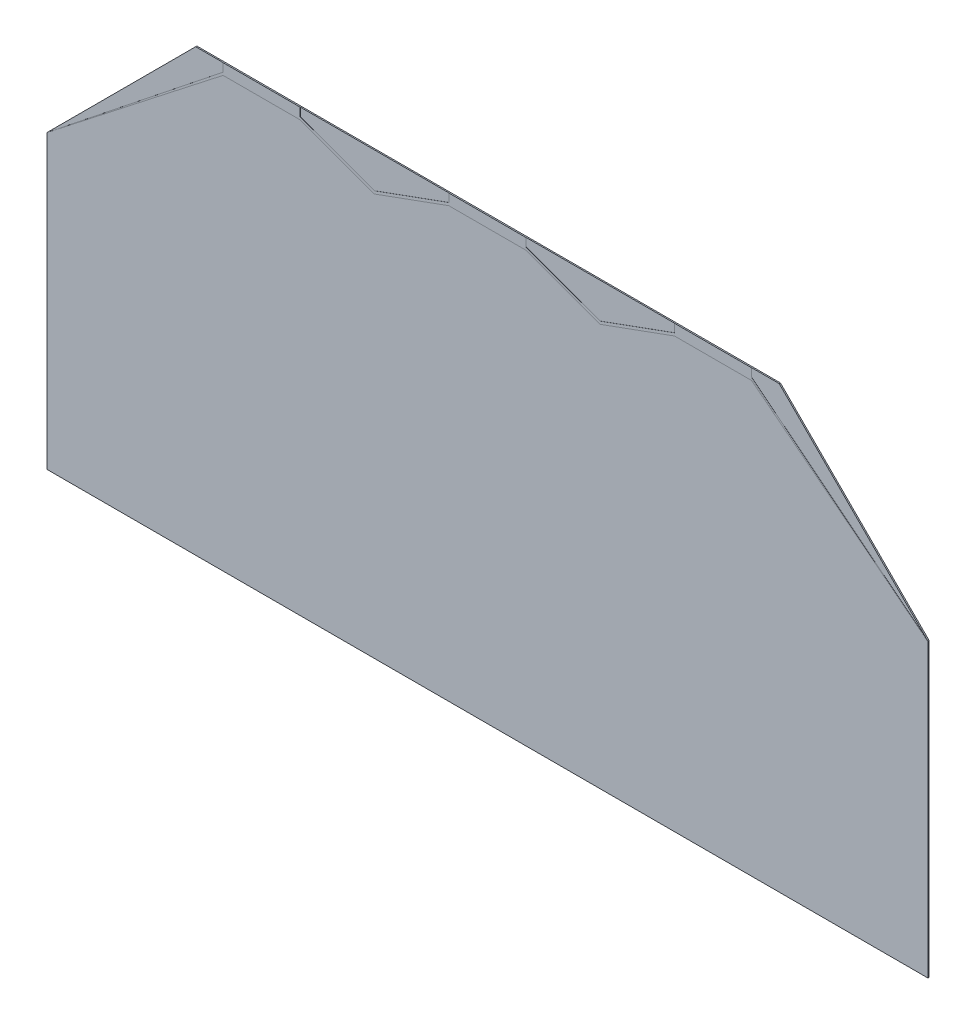
ISO-10303-21;
HEADER;
FILE_DESCRIPTION(('STEP AP214'),'2;1');
FILE_NAME('part.step','',(''),(''),'','','');
FILE_SCHEMA(('AUTOMOTIVE_DESIGN { 1 0 10303 214 1 1 1 1 }'));
ENDSEC;
DATA;
#1=APPLICATION_CONTEXT('core data for automotive mechanical design processes');
#2=APPLICATION_PROTOCOL_DEFINITION('international standard','automotive_design',2000,#1);
#3=PRODUCT_CONTEXT('',#1,'mechanical');
#4=PRODUCT('Part','Part','',(#3));
#5=PRODUCT_RELATED_PRODUCT_CATEGORY('part','',(#4));
#6=PRODUCT_DEFINITION_FORMATION('','',#4);
#7=PRODUCT_DEFINITION_CONTEXT('part definition',#1,'design');
#8=PRODUCT_DEFINITION('design','',#6,#7);
#9=PRODUCT_DEFINITION_SHAPE('','',#8);
#10=(LENGTH_UNIT() NAMED_UNIT(*) SI_UNIT(.MILLI.,.METRE.));
#11=(NAMED_UNIT(*) PLANE_ANGLE_UNIT() SI_UNIT($,.RADIAN.));
#12=(NAMED_UNIT(*) SI_UNIT($,.STERADIAN.) SOLID_ANGLE_UNIT());
#13=UNCERTAINTY_MEASURE_WITH_UNIT(LENGTH_MEASURE(1.E-05),#10,'distance_accuracy_value','');
#14=(GEOMETRIC_REPRESENTATION_CONTEXT(3) GLOBAL_UNCERTAINTY_ASSIGNED_CONTEXT((#13)) GLOBAL_UNIT_ASSIGNED_CONTEXT((#10,
#11,#12)) REPRESENTATION_CONTEXT('',''));
#15=CARTESIAN_POINT('',(0.,0.,0.));
#16=DIRECTION('',(0.,0.,1.));
#17=DIRECTION('',(1.,0.,0.));
#18=AXIS2_PLACEMENT_3D('',#15,#16,#17);
#19=CARTESIAN_POINT('',(0.,0.,-0.11));
#20=DIRECTION('',(0.,0.,1.));
#21=DIRECTION('',(1.,0.,0.));
#22=AXIS2_PLACEMENT_3D('',#19,#20,#21);
#23=PLANE('',#22);
#24=DIRECTION('',(-0.707106781186548,-0.707106781186548,0.));
#25=VECTOR('',#24,1.);
#26=CARTESIAN_POINT('',(-33.25,13.25,-0.11));
#27=LINE('',#26,#25);
#28=CARTESIAN_POINT('',(-26.5,20.,-0.11));
#29=VERTEX_POINT('',#28);
#30=CARTESIAN_POINT('',(-40.,6.5,-0.11));
#31=VERTEX_POINT('',#30);
#32=EDGE_CURVE('P0_E26',#29,#31,#27,.T.);
#33=ORIENTED_EDGE('',*,*,#32,.F.);
#34=DIRECTION('',(-1.,0.,0.));
#35=VECTOR('',#34,1.);
#36=CARTESIAN_POINT('',(0.,20.,-0.11));
#37=LINE('',#36,#35);
#38=CARTESIAN_POINT('',(26.5,20.,-0.11));
#39=VERTEX_POINT('',#38);
#40=EDGE_CURVE('P0_E135',#39,#29,#37,.T.);
#41=ORIENTED_EDGE('',*,*,#40,.F.);
#42=DIRECTION('',(-0.707106781186548,0.707106781186548,0.));
#43=VECTOR('',#42,1.);
#44=CARTESIAN_POINT('',(33.25,13.25,-0.11));
#45=LINE('',#44,#43);
#46=CARTESIAN_POINT('',(40.,6.5,-0.11));
#47=VERTEX_POINT('',#46);
#48=EDGE_CURVE('P0_E129',#47,#39,#45,.T.);
#49=ORIENTED_EDGE('',*,*,#48,.F.);
#50=DIRECTION('',(0.,1.,0.));
#51=VECTOR('',#50,1.);
#52=CARTESIAN_POINT('',(40.,-6.75,-0.11));
#53=LINE('',#52,#51);
#54=CARTESIAN_POINT('',(40.,-20.,-0.11));
#55=VERTEX_POINT('',#54);
#56=EDGE_CURVE('P0_E93',#55,#47,#53,.T.);
#57=ORIENTED_EDGE('',*,*,#56,.F.);
#58=DIRECTION('',(1.,0.,0.));
#59=VECTOR('',#58,1.);
#60=CARTESIAN_POINT('',(0.,-20.,-0.11));
#61=LINE('',#60,#59);
#62=CARTESIAN_POINT('',(-40.,-20.,-0.11));
#63=VERTEX_POINT('',#62);
#64=EDGE_CURVE('P0_E87',#63,#55,#61,.T.);
#65=ORIENTED_EDGE('',*,*,#64,.F.);
#66=DIRECTION('',(0.,-1.,0.));
#67=VECTOR('',#66,1.);
#68=CARTESIAN_POINT('',(-40.,-6.75,-0.11));
#69=LINE('',#68,#67);
#70=EDGE_CURVE('P0_E91',#31,#63,#69,.T.);
#71=ORIENTED_EDGE('',*,*,#70,.F.);
#72=EDGE_LOOP('',(#33,#41,#49,#57,#65,#71));
#73=FACE_BOUND('',#72,.T.);
#74=ADVANCED_FACE('P0_F16',(#73),#23,.F.);
#75=CARTESIAN_POINT('',(0.,0.,0.));
#76=DIRECTION('',(0.,0.,1.));
#77=DIRECTION('',(1.,0.,0.));
#78=AXIS2_PLACEMENT_3D('',#75,#76,#77);
#79=PLANE('',#78);
#80=DIRECTION('',(0.,-1.,0.));
#81=VECTOR('',#80,1.);
#82=CARTESIAN_POINT('',(-40.,-6.75,0.));
#83=LINE('',#82,#81);
#84=CARTESIAN_POINT('',(-40.,6.5,0.));
#85=VERTEX_POINT('',#84);
#86=CARTESIAN_POINT('',(-40.,-20.,0.));
#87=VERTEX_POINT('',#86);
#88=EDGE_CURVE('P0_E110',#85,#87,#83,.T.);
#89=ORIENTED_EDGE('',*,*,#88,.T.);
#90=DIRECTION('',(1.,0.,0.));
#91=VECTOR('',#90,1.);
#92=CARTESIAN_POINT('',(0.,-20.,0.));
#93=LINE('',#92,#91);
#94=CARTESIAN_POINT('',(40.,-20.,0.));
#95=VERTEX_POINT('',#94);
#96=EDGE_CURVE('P0_E105',#87,#95,#93,.T.);
#97=ORIENTED_EDGE('',*,*,#96,.T.);
#98=DIRECTION('',(0.,1.,0.));
#99=VECTOR('',#98,1.);
#100=CARTESIAN_POINT('',(40.,-6.75,0.));
#101=LINE('',#100,#99);
#102=CARTESIAN_POINT('',(40.,6.5,0.));
#103=VERTEX_POINT('',#102);
#104=EDGE_CURVE('P0_E125',#95,#103,#101,.T.);
#105=ORIENTED_EDGE('',*,*,#104,.T.);
#106=DIRECTION('',(-0.707106781186548,0.707106781186548,0.));
#107=VECTOR('',#106,1.);
#108=CARTESIAN_POINT('',(33.25,13.25,0.));
#109=LINE('',#108,#107);
#110=CARTESIAN_POINT('',(26.5,20.,0.));
#111=VERTEX_POINT('',#110);
#112=EDGE_CURVE('P0_E131',#103,#111,#109,.T.);
#113=ORIENTED_EDGE('',*,*,#112,.T.);
#114=DIRECTION('',(-1.,0.,0.));
#115=VECTOR('',#114,1.);
#116=CARTESIAN_POINT('',(0.,20.,0.));
#117=LINE('',#116,#115);
#118=CARTESIAN_POINT('',(-26.5,20.,0.));
#119=VERTEX_POINT('',#118);
#120=EDGE_CURVE('P0_E138',#111,#119,#117,.T.);
#121=ORIENTED_EDGE('',*,*,#120,.T.);
#122=DIRECTION('',(-0.707106781186548,-0.707106781186548,0.));
#123=VECTOR('',#122,1.);
#124=CARTESIAN_POINT('',(-33.25,13.25,0.));
#125=LINE('',#124,#123);
#126=EDGE_CURVE('P0_E11',#119,#85,#125,.T.);
#127=ORIENTED_EDGE('',*,*,#126,.T.);
#128=EDGE_LOOP('',(#89,#97,#105,#113,#121,#127));
#129=FACE_BOUND('',#128,.T.);
#130=ADVANCED_FACE('P0_F18',(#129),#79,.T.);
#131=CARTESIAN_POINT('',(-26.5,20.,0.));
#132=DIRECTION('',(0.707106781186548,-0.707106781186548,0.));
#133=DIRECTION('',(-0.707106781186548,-0.707106781186548,0.));
#134=AXIS2_PLACEMENT_3D('',#131,#132,#133);
#135=PLANE('',#134);
#136=ORIENTED_EDGE('',*,*,#32,.T.);
#137=DIRECTION('',(0.,0.,-1.));
#138=VECTOR('',#137,1.);
#139=CARTESIAN_POINT('',(-40.,6.5,-0.055));
#140=LINE('',#139,#138);
#141=EDGE_CURVE('P0_E99',#85,#31,#140,.T.);
#142=ORIENTED_EDGE('',*,*,#141,.F.);
#143=ORIENTED_EDGE('',*,*,#126,.F.);
#144=DIRECTION('',(0.,0.,-1.));
#145=VECTOR('',#144,1.);
#146=CARTESIAN_POINT('',(-26.5,20.,-0.055));
#147=LINE('',#146,#145);
#148=EDGE_CURVE('P0_E20',#119,#29,#147,.T.);
#149=ORIENTED_EDGE('',*,*,#148,.T.);
#150=EDGE_LOOP('',(#136,#142,#143,#149));
#151=FACE_BOUND('',#150,.T.);
#152=ADVANCED_FACE('P0_F303',(#151),#135,.F.);
#153=CARTESIAN_POINT('',(26.5,20.,0.));
#154=DIRECTION('',(0.,-1.,0.));
#155=DIRECTION('',(-1.,0.,0.));
#156=AXIS2_PLACEMENT_3D('',#153,#154,#155);
#157=PLANE('',#156);
#158=ORIENTED_EDGE('',*,*,#40,.T.);
#159=ORIENTED_EDGE('',*,*,#148,.F.);
#160=ORIENTED_EDGE('',*,*,#120,.F.);
#161=DIRECTION('',(0.,0.,-1.));
#162=VECTOR('',#161,1.);
#163=CARTESIAN_POINT('',(26.5,20.,-0.055));
#164=LINE('',#163,#162);
#165=EDGE_CURVE('P0_E136',#111,#39,#164,.T.);
#166=ORIENTED_EDGE('',*,*,#165,.T.);
#167=EDGE_LOOP('',(#158,#159,#160,#166));
#168=FACE_BOUND('',#167,.T.);
#169=ADVANCED_FACE('P0_F285',(#168),#157,.F.);
#170=CARTESIAN_POINT('',(40.,6.5,0.));
#171=DIRECTION('',(-0.707106781186548,-0.707106781186548,0.));
#172=DIRECTION('',(-0.707106781186548,0.707106781186548,0.));
#173=AXIS2_PLACEMENT_3D('',#170,#171,#172);
#174=PLANE('',#173);
#175=ORIENTED_EDGE('',*,*,#48,.T.);
#176=ORIENTED_EDGE('',*,*,#165,.F.);
#177=ORIENTED_EDGE('',*,*,#112,.F.);
#178=DIRECTION('',(0.,0.,-1.));
#179=VECTOR('',#178,1.);
#180=CARTESIAN_POINT('',(40.,6.5,-0.055));
#181=LINE('',#180,#179);
#182=EDGE_CURVE('P0_E130',#103,#47,#181,.T.);
#183=ORIENTED_EDGE('',*,*,#182,.T.);
#184=EDGE_LOOP('',(#175,#176,#177,#183));
#185=FACE_BOUND('',#184,.T.);
#186=ADVANCED_FACE('P0_F161',(#185),#174,.F.);
#187=CARTESIAN_POINT('',(40.,-20.,0.));
#188=DIRECTION('',(-1.,0.,0.));
#189=DIRECTION('',(0.,1.,0.));
#190=AXIS2_PLACEMENT_3D('',#187,#188,#189);
#191=PLANE('',#190);
#192=ORIENTED_EDGE('',*,*,#56,.T.);
#193=ORIENTED_EDGE('',*,*,#182,.F.);
#194=ORIENTED_EDGE('',*,*,#104,.F.);
#195=DIRECTION('',(0.,0.,-1.));
#196=VECTOR('',#195,1.);
#197=CARTESIAN_POINT('',(40.,-20.,-0.055));
#198=LINE('',#197,#196);
#199=EDGE_CURVE('P0_E98',#95,#55,#198,.T.);
#200=ORIENTED_EDGE('',*,*,#199,.T.);
#201=EDGE_LOOP('',(#192,#193,#194,#200));
#202=FACE_BOUND('',#201,.T.);
#203=ADVANCED_FACE('P0_F165',(#202),#191,.F.);
#204=CARTESIAN_POINT('',(-40.,-20.,0.));
#205=DIRECTION('',(0.,1.,0.));
#206=DIRECTION('',(1.,0.,0.));
#207=AXIS2_PLACEMENT_3D('',#204,#205,#206);
#208=PLANE('',#207);
#209=ORIENTED_EDGE('',*,*,#64,.T.);
#210=ORIENTED_EDGE('',*,*,#199,.F.);
#211=ORIENTED_EDGE('',*,*,#96,.F.);
#212=DIRECTION('',(0.,0.,-1.));
#213=VECTOR('',#212,1.);
#214=CARTESIAN_POINT('',(-40.,-20.,-0.055));
#215=LINE('',#214,#213);
#216=EDGE_CURVE('P0_E102',#87,#63,#215,.T.);
#217=ORIENTED_EDGE('',*,*,#216,.T.);
#218=EDGE_LOOP('',(#209,#210,#211,#217));
#219=FACE_BOUND('',#218,.T.);
#220=ADVANCED_FACE('P0_F103',(#219),#208,.F.);
#221=CARTESIAN_POINT('',(-40.,6.5,0.));
#222=DIRECTION('',(1.,0.,0.));
#223=DIRECTION('',(0.,-1.,0.));
#224=AXIS2_PLACEMENT_3D('',#221,#222,#223);
#225=PLANE('',#224);
#226=ORIENTED_EDGE('',*,*,#70,.T.);
#227=ORIENTED_EDGE('',*,*,#216,.F.);
#228=ORIENTED_EDGE('',*,*,#88,.F.);
#229=ORIENTED_EDGE('',*,*,#141,.T.);
#230=EDGE_LOOP('',(#226,#227,#228,#229));
#231=FACE_BOUND('',#230,.T.);
#232=ADVANCED_FACE('P0_F114',(#231),#225,.F.);
#233=CLOSED_SHELL('',(#74,#130,#152,#169,#186,#203,#220,#232));
#234=MANIFOLD_SOLID_BREP('P0_B1',#233);
#235=CARTESIAN_POINT('',(0.,0.,0.01));
#236=DIRECTION('',(0.,0.,1.));
#237=DIRECTION('',(1.,0.,0.));
#238=AXIS2_PLACEMENT_3D('',#235,#236,#237);
#239=PLANE('',#238);
#240=DIRECTION('',(0.,-1.,0.));
#241=VECTOR('',#240,1.);
#242=CARTESIAN_POINT('',(-24.,19.625,0.01));
#243=LINE('',#242,#241);
#244=CARTESIAN_POINT('',(-24.,20.,0.01));
#245=VERTEX_POINT('',#244);
#246=CARTESIAN_POINT('',(-24.,19.25,0.01));
#247=VERTEX_POINT('',#246);
#248=EDGE_CURVE('P1_E388',#245,#247,#243,.T.);
#249=ORIENTED_EDGE('',*,*,#248,.T.);
#250=DIRECTION('',(-0.782059551443419,-0.623203705056475,0.));
#251=VECTOR('',#250,1.);
#252=CARTESIAN_POINT('',(-32.,12.875,0.01));
#253=LINE('',#252,#251);
#254=CARTESIAN_POINT('',(-40.,6.5,0.01));
#255=VERTEX_POINT('',#254);
#256=EDGE_CURVE('P1_E469',#247,#255,#253,.T.);
#257=ORIENTED_EDGE('',*,*,#256,.T.);
#258=DIRECTION('',(0.788024373724563,0.615644041972315,0.));
#259=VECTOR('',#258,1.);
#260=CARTESIAN_POINT('',(-32.,12.75,0.01));
#261=LINE('',#260,#259);
#262=CARTESIAN_POINT('',(-24.,19.,0.01));
#263=VERTEX_POINT('',#262);
#264=EDGE_CURVE('P1_E437',#255,#263,#261,.T.);
#265=ORIENTED_EDGE('',*,*,#264,.T.);
#266=DIRECTION('',(1.,0.,0.));
#267=VECTOR('',#266,1.);
#268=CARTESIAN_POINT('',(-20.5,19.,0.01));
#269=LINE('',#268,#267);
#270=CARTESIAN_POINT('',(-17.,19.,0.01));
#271=VERTEX_POINT('',#270);
#272=EDGE_CURVE('P1_E379',#263,#271,#269,.T.);
#273=ORIENTED_EDGE('',*,*,#272,.T.);
#274=DIRECTION('',(0.939692620785908,-0.34202014332567,0.));
#275=VECTOR('',#274,1.);
#276=CARTESIAN_POINT('',(-13.625,17.7716004593516,0.01));
#277=LINE('',#276,#275);
#278=CARTESIAN_POINT('',(-10.25,16.5432009187031,0.01));
#279=VERTEX_POINT('',#278);
#280=EDGE_CURVE('P1_E291',#271,#279,#277,.T.);
#281=ORIENTED_EDGE('',*,*,#280,.T.);
#282=DIRECTION('',(0.939692620785909,0.342020143325667,0.));
#283=VECTOR('',#282,1.);
#284=CARTESIAN_POINT('',(-6.875,17.7716004593516,0.01));
#285=LINE('',#284,#283);
#286=CARTESIAN_POINT('',(-3.5,19.,0.01));
#287=VERTEX_POINT('',#286);
#288=EDGE_CURVE('P1_E273',#279,#287,#285,.T.);
#289=ORIENTED_EDGE('',*,*,#288,.T.);
#290=DIRECTION('',(1.,0.,0.));
#291=VECTOR('',#290,1.);
#292=CARTESIAN_POINT('',(-1.75,19.,0.01));
#293=LINE('',#292,#291);
#294=CARTESIAN_POINT('',(0.,19.,0.01));
#295=VERTEX_POINT('',#294);
#296=EDGE_CURVE('P1_E280',#287,#295,#293,.T.);
#297=ORIENTED_EDGE('',*,*,#296,.T.);
#298=DIRECTION('',(1.,0.,0.));
#299=VECTOR('',#298,1.);
#300=CARTESIAN_POINT('',(1.75,19.,0.01));
#301=LINE('',#300,#299);
#302=CARTESIAN_POINT('',(3.5,19.,0.01));
#303=VERTEX_POINT('',#302);
#304=EDGE_CURVE('P1_E349',#295,#303,#301,.T.);
#305=ORIENTED_EDGE('',*,*,#304,.T.);
#306=DIRECTION('',(0.939692620785909,-0.342020143325667,0.));
#307=VECTOR('',#306,1.);
#308=CARTESIAN_POINT('',(6.875,17.7716004593516,0.01));
#309=LINE('',#308,#307);
#310=CARTESIAN_POINT('',(10.25,16.5432009187031,0.01));
#311=VERTEX_POINT('',#310);
#312=EDGE_CURVE('P1_E67',#303,#311,#309,.T.);
#313=ORIENTED_EDGE('',*,*,#312,.T.);
#314=DIRECTION('',(0.939692620785908,0.34202014332567,0.));
#315=VECTOR('',#314,1.);
#316=CARTESIAN_POINT('',(13.625,17.7716004593516,0.01));
#317=LINE('',#316,#315);
#318=CARTESIAN_POINT('',(17.,19.,0.01));
#319=VERTEX_POINT('',#318);
#320=EDGE_CURVE('P1_E462',#311,#319,#317,.T.);
#321=ORIENTED_EDGE('',*,*,#320,.T.);
#322=DIRECTION('',(1.,0.,0.));
#323=VECTOR('',#322,1.);
#324=CARTESIAN_POINT('',(20.5,19.,0.01));
#325=LINE('',#324,#323);
#326=CARTESIAN_POINT('',(24.,19.,0.01));
#327=VERTEX_POINT('',#326);
#328=EDGE_CURVE('P1_E443',#319,#327,#325,.T.);
#329=ORIENTED_EDGE('',*,*,#328,.T.);
#330=DIRECTION('',(0.788024373724563,-0.615644041972315,0.));
#331=VECTOR('',#330,1.);
#332=CARTESIAN_POINT('',(32.,12.75,0.01));
#333=LINE('',#332,#331);
#334=CARTESIAN_POINT('',(40.,6.5,0.01));
#335=VERTEX_POINT('',#334);
#336=EDGE_CURVE('P1_E368',#327,#335,#333,.T.);
#337=ORIENTED_EDGE('',*,*,#336,.T.);
#338=DIRECTION('',(-0.782059551443419,0.623203705056475,0.));
#339=VECTOR('',#338,1.);
#340=CARTESIAN_POINT('',(32.,12.875,0.01));
#341=LINE('',#340,#339);
#342=CARTESIAN_POINT('',(24.,19.25,0.01));
#343=VERTEX_POINT('',#342);
#344=EDGE_CURVE('P1_E528',#335,#343,#341,.T.);
#345=ORIENTED_EDGE('',*,*,#344,.T.);
#346=DIRECTION('',(0.,1.,0.));
#347=VECTOR('',#346,1.);
#348=CARTESIAN_POINT('',(24.,19.625,0.01));
#349=LINE('',#348,#347);
#350=CARTESIAN_POINT('',(24.,20.,0.01));
#351=VERTEX_POINT('',#350);
#352=EDGE_CURVE('P1_E404',#343,#351,#349,.T.);
#353=ORIENTED_EDGE('',*,*,#352,.T.);
#354=DIRECTION('',(-1.,0.,0.));
#355=VECTOR('',#354,1.);
#356=CARTESIAN_POINT('',(20.5,20.,0.01));
#357=LINE('',#356,#355);
#358=CARTESIAN_POINT('',(17.,20.,0.01));
#359=VERTEX_POINT('',#358);
#360=EDGE_CURVE('P1_E357',#351,#359,#357,.T.);
#361=ORIENTED_EDGE('',*,*,#360,.T.);
#362=DIRECTION('',(0.,-1.,0.));
#363=VECTOR('',#362,1.);
#364=CARTESIAN_POINT('',(17.,19.625,0.01));
#365=LINE('',#364,#363);
#366=CARTESIAN_POINT('',(17.,19.25,0.01));
#367=VERTEX_POINT('',#366);
#368=EDGE_CURVE('P1_E403',#359,#367,#365,.T.);
#369=ORIENTED_EDGE('',*,*,#368,.T.);
#370=DIRECTION('',(-0.939692620785908,-0.34202014332567,0.));
#371=VECTOR('',#370,1.);
#372=CARTESIAN_POINT('',(13.625,18.0216004593516,0.01));
#373=LINE('',#372,#371);
#374=CARTESIAN_POINT('',(10.25,16.7932009187031,0.01));
#375=VERTEX_POINT('',#374);
#376=EDGE_CURVE('P1_E389',#367,#375,#373,.T.);
#377=ORIENTED_EDGE('',*,*,#376,.T.);
#378=DIRECTION('',(-0.939692620785909,0.342020143325667,0.));
#379=VECTOR('',#378,1.);
#380=CARTESIAN_POINT('',(6.875,18.0216004593516,0.01));
#381=LINE('',#380,#379);
#382=CARTESIAN_POINT('',(3.49999999999993,19.25,0.01));
#383=VERTEX_POINT('',#382);
#384=EDGE_CURVE('P1_E98',#375,#383,#381,.T.);
#385=ORIENTED_EDGE('',*,*,#384,.T.);
#386=DIRECTION('',(0.,1.,0.));
#387=VECTOR('',#386,1.);
#388=CARTESIAN_POINT('',(3.5,19.625,0.01));
#389=LINE('',#388,#387);
#390=CARTESIAN_POINT('',(3.5,20.,0.01));
#391=VERTEX_POINT('',#390);
#392=EDGE_CURVE('P1_E608',#383,#391,#389,.T.);
#393=ORIENTED_EDGE('',*,*,#392,.T.);
#394=DIRECTION('',(-1.,0.,0.));
#395=VECTOR('',#394,1.);
#396=CARTESIAN_POINT('',(1.75,20.,0.01));
#397=LINE('',#396,#395);
#398=CARTESIAN_POINT('',(0.,20.,0.01));
#399=VERTEX_POINT('',#398);
#400=EDGE_CURVE('P1_E320',#391,#399,#397,.T.);
#401=ORIENTED_EDGE('',*,*,#400,.T.);
#402=DIRECTION('',(-1.,0.,0.));
#403=VECTOR('',#402,1.);
#404=CARTESIAN_POINT('',(-1.75,20.,0.01));
#405=LINE('',#404,#403);
#406=CARTESIAN_POINT('',(-3.5,20.,0.01));
#407=VERTEX_POINT('',#406);
#408=EDGE_CURVE('P1_E397',#399,#407,#405,.T.);
#409=ORIENTED_EDGE('',*,*,#408,.T.);
#410=DIRECTION('',(0.,-1.,0.));
#411=VECTOR('',#410,1.);
#412=CARTESIAN_POINT('',(-3.5,19.625,0.01));
#413=LINE('',#412,#411);
#414=CARTESIAN_POINT('',(-3.5,19.25,0.01));
#415=VERTEX_POINT('',#414);
#416=EDGE_CURVE('P1_E344',#407,#415,#413,.T.);
#417=ORIENTED_EDGE('',*,*,#416,.T.);
#418=DIRECTION('',(-0.939692620785909,-0.342020143325667,0.));
#419=VECTOR('',#418,1.);
#420=CARTESIAN_POINT('',(-6.875,18.0216004593516,0.01));
#421=LINE('',#420,#419);
#422=CARTESIAN_POINT('',(-10.25,16.7932009187031,0.01));
#423=VERTEX_POINT('',#422);
#424=EDGE_CURVE('P1_E322',#415,#423,#421,.T.);
#425=ORIENTED_EDGE('',*,*,#424,.T.);
#426=DIRECTION('',(-0.939692620785908,0.34202014332567,0.));
#427=VECTOR('',#426,1.);
#428=CARTESIAN_POINT('',(-13.625,18.0216004593516,0.01));
#429=LINE('',#428,#427);
#430=CARTESIAN_POINT('',(-17.,19.25,0.01));
#431=VERTEX_POINT('',#430);
#432=EDGE_CURVE('P1_E454',#423,#431,#429,.T.);
#433=ORIENTED_EDGE('',*,*,#432,.T.);
#434=DIRECTION('',(0.,1.,0.));
#435=VECTOR('',#434,1.);
#436=CARTESIAN_POINT('',(-17.,19.625,0.01));
#437=LINE('',#436,#435);
#438=CARTESIAN_POINT('',(-17.,20.,0.01));
#439=VERTEX_POINT('',#438);
#440=EDGE_CURVE('P1_E305',#431,#439,#437,.T.);
#441=ORIENTED_EDGE('',*,*,#440,.T.);
#442=DIRECTION('',(-1.,0.,0.));
#443=VECTOR('',#442,1.);
#444=CARTESIAN_POINT('',(-20.5,20.,0.01));
#445=LINE('',#444,#443);
#446=EDGE_CURVE('P1_E11',#439,#245,#445,.T.);
#447=ORIENTED_EDGE('',*,*,#446,.T.);
#448=EDGE_LOOP('',(#249,#257,#265,#273,#281,#289,#297,#305,#313,#321,#329,#337,#345,#353,#361,
#369,#377,#385,#393,#401,#409,#417,#425,#433,#441,#447));
#449=FACE_BOUND('',#448,.T.);
#450=ADVANCED_FACE('P1_F16',(#449),#239,.T.);
#451=CARTESIAN_POINT('',(0.,0.,0.));
#452=DIRECTION('',(0.,0.,1.));
#453=DIRECTION('',(1.,0.,0.));
#454=AXIS2_PLACEMENT_3D('',#451,#452,#453);
#455=PLANE('',#454);
#456=DIRECTION('',(-1.,0.,0.));
#457=VECTOR('',#456,1.);
#458=CARTESIAN_POINT('',(-20.5,20.,0.));
#459=LINE('',#458,#457);
#460=CARTESIAN_POINT('',(-17.,20.,0.));
#461=VERTEX_POINT('',#460);
#462=CARTESIAN_POINT('',(-24.,20.,0.));
#463=VERTEX_POINT('',#462);
#464=EDGE_CURVE('P1_E26',#461,#463,#459,.T.);
#465=ORIENTED_EDGE('',*,*,#464,.F.);
#466=DIRECTION('',(0.,1.,0.));
#467=VECTOR('',#466,1.);
#468=CARTESIAN_POINT('',(-17.,19.625,0.));
#469=LINE('',#468,#467);
#470=CARTESIAN_POINT('',(-17.,19.25,0.));
#471=VERTEX_POINT('',#470);
#472=EDGE_CURVE('P1_E450',#471,#461,#469,.T.);
#473=ORIENTED_EDGE('',*,*,#472,.F.);
#474=DIRECTION('',(-0.939692620785908,0.34202014332567,0.));
#475=VECTOR('',#474,1.);
#476=CARTESIAN_POINT('',(-13.625,18.0216004593516,0.));
#477=LINE('',#476,#475);
#478=CARTESIAN_POINT('',(-10.25,16.7932009187031,0.));
#479=VERTEX_POINT('',#478);
#480=EDGE_CURVE('P1_E325',#479,#471,#477,.T.);
#481=ORIENTED_EDGE('',*,*,#480,.F.);
#482=DIRECTION('',(-0.939692620785909,-0.342020143325667,0.));
#483=VECTOR('',#482,1.);
#484=CARTESIAN_POINT('',(-6.875,18.0216004593516,0.));
#485=LINE('',#484,#483);
#486=CARTESIAN_POINT('',(-3.5,19.25,0.));
#487=VERTEX_POINT('',#486);
#488=EDGE_CURVE('P1_E336',#487,#479,#485,.T.);
#489=ORIENTED_EDGE('',*,*,#488,.F.);
#490=DIRECTION('',(0.,-1.,0.));
#491=VECTOR('',#490,1.);
#492=CARTESIAN_POINT('',(-3.5,19.625,0.));
#493=LINE('',#492,#491);
#494=CARTESIAN_POINT('',(-3.5,20.,0.));
#495=VERTEX_POINT('',#494);
#496=EDGE_CURVE('P1_E392',#495,#487,#493,.T.);
#497=ORIENTED_EDGE('',*,*,#496,.F.);
#498=DIRECTION('',(-1.,0.,0.));
#499=VECTOR('',#498,1.);
#500=CARTESIAN_POINT('',(-1.75,20.,0.));
#501=LINE('',#500,#499);
#502=CARTESIAN_POINT('',(0.,20.,0.));
#503=VERTEX_POINT('',#502);
#504=EDGE_CURVE('P1_E477',#503,#495,#501,.T.);
#505=ORIENTED_EDGE('',*,*,#504,.F.);
#506=DIRECTION('',(-1.,0.,0.));
#507=VECTOR('',#506,1.);
#508=CARTESIAN_POINT('',(1.75,20.,0.));
#509=LINE('',#508,#507);
#510=CARTESIAN_POINT('',(3.5,20.,0.));
#511=VERTEX_POINT('',#510);
#512=EDGE_CURVE('P1_E321',#511,#503,#509,.T.);
#513=ORIENTED_EDGE('',*,*,#512,.F.);
#514=DIRECTION('',(0.,1.,0.));
#515=VECTOR('',#514,1.);
#516=CARTESIAN_POINT('',(3.5,19.625,0.));
#517=LINE('',#516,#515);
#518=CARTESIAN_POINT('',(3.49999999999993,19.25,0.));
#519=VERTEX_POINT('',#518);
#520=EDGE_CURVE('P1_E300',#519,#511,#517,.T.);
#521=ORIENTED_EDGE('',*,*,#520,.F.);
#522=DIRECTION('',(-0.939692620785909,0.342020143325667,0.));
#523=VECTOR('',#522,1.);
#524=CARTESIAN_POINT('',(6.875,18.0216004593516,0.));
#525=LINE('',#524,#523);
#526=CARTESIAN_POINT('',(10.25,16.7932009187031,0.));
#527=VERTEX_POINT('',#526);
#528=EDGE_CURVE('P1_E114',#527,#519,#525,.T.);
#529=ORIENTED_EDGE('',*,*,#528,.F.);
#530=DIRECTION('',(-0.939692620785908,-0.34202014332567,0.));
#531=VECTOR('',#530,1.);
#532=CARTESIAN_POINT('',(13.625,18.0216004593516,0.));
#533=LINE('',#532,#531);
#534=CARTESIAN_POINT('',(17.,19.25,0.));
#535=VERTEX_POINT('',#534);
#536=EDGE_CURVE('P1_E475',#535,#527,#533,.T.);
#537=ORIENTED_EDGE('',*,*,#536,.F.);
#538=DIRECTION('',(0.,-1.,0.));
#539=VECTOR('',#538,1.);
#540=CARTESIAN_POINT('',(17.,19.625,0.));
#541=LINE('',#540,#539);
#542=CARTESIAN_POINT('',(17.,20.,0.));
#543=VERTEX_POINT('',#542);
#544=EDGE_CURVE('P1_E359',#543,#535,#541,.T.);
#545=ORIENTED_EDGE('',*,*,#544,.F.);
#546=DIRECTION('',(-1.,0.,0.));
#547=VECTOR('',#546,1.);
#548=CARTESIAN_POINT('',(20.5,20.,0.));
#549=LINE('',#548,#547);
#550=CARTESIAN_POINT('',(24.,20.,0.));
#551=VERTEX_POINT('',#550);
#552=EDGE_CURVE('P1_E358',#551,#543,#549,.T.);
#553=ORIENTED_EDGE('',*,*,#552,.F.);
#554=DIRECTION('',(0.,1.,0.));
#555=VECTOR('',#554,1.);
#556=CARTESIAN_POINT('',(24.,19.625,0.));
#557=LINE('',#556,#555);
#558=CARTESIAN_POINT('',(24.,19.25,0.));
#559=VERTEX_POINT('',#558);
#560=EDGE_CURVE('P1_E525',#559,#551,#557,.T.);
#561=ORIENTED_EDGE('',*,*,#560,.F.);
#562=DIRECTION('',(-0.782059551443419,0.623203705056475,0.));
#563=VECTOR('',#562,1.);
#564=CARTESIAN_POINT('',(32.,12.875,0.));
#565=LINE('',#564,#563);
#566=CARTESIAN_POINT('',(40.,6.5,0.));
#567=VERTEX_POINT('',#566);
#568=EDGE_CURVE('P1_E370',#567,#559,#565,.T.);
#569=ORIENTED_EDGE('',*,*,#568,.F.);
#570=DIRECTION('',(0.788024373724563,-0.615644041972315,0.));
#571=VECTOR('',#570,1.);
#572=CARTESIAN_POINT('',(32.,12.75,0.));
#573=LINE('',#572,#571);
#574=CARTESIAN_POINT('',(24.,19.,0.));
#575=VERTEX_POINT('',#574);
#576=EDGE_CURVE('P1_E369',#575,#567,#573,.T.);
#577=ORIENTED_EDGE('',*,*,#576,.F.);
#578=DIRECTION('',(1.,0.,0.));
#579=VECTOR('',#578,1.);
#580=CARTESIAN_POINT('',(20.5,19.,0.));
#581=LINE('',#580,#579);
#582=CARTESIAN_POINT('',(17.,19.,0.));
#583=VERTEX_POINT('',#582);
#584=EDGE_CURVE('P1_E444',#583,#575,#581,.T.);
#585=ORIENTED_EDGE('',*,*,#584,.F.);
#586=DIRECTION('',(0.939692620785908,0.34202014332567,0.));
#587=VECTOR('',#586,1.);
#588=CARTESIAN_POINT('',(13.625,17.7716004593516,0.));
#589=LINE('',#588,#587);
#590=CARTESIAN_POINT('',(10.25,16.5432009187031,0.));
#591=VERTEX_POINT('',#590);
#592=EDGE_CURVE('P1_E308',#591,#583,#589,.T.);
#593=ORIENTED_EDGE('',*,*,#592,.F.);
#594=DIRECTION('',(0.939692620785909,-0.342020143325667,0.));
#595=VECTOR('',#594,1.);
#596=CARTESIAN_POINT('',(6.875,17.7716004593516,0.));
#597=LINE('',#596,#595);
#598=CARTESIAN_POINT('',(3.5,19.,0.));
#599=VERTEX_POINT('',#598);
#600=EDGE_CURVE('P1_E83',#599,#591,#597,.T.);
#601=ORIENTED_EDGE('',*,*,#600,.F.);
#602=DIRECTION('',(1.,0.,0.));
#603=VECTOR('',#602,1.);
#604=CARTESIAN_POINT('',(1.75,19.,0.));
#605=LINE('',#604,#603);
#606=CARTESIAN_POINT('',(0.,19.,0.));
#607=VERTEX_POINT('',#606);
#608=EDGE_CURVE('P1_E267',#607,#599,#605,.T.);
#609=ORIENTED_EDGE('',*,*,#608,.F.);
#610=DIRECTION('',(1.,0.,0.));
#611=VECTOR('',#610,1.);
#612=CARTESIAN_POINT('',(-1.75,19.,0.));
#613=LINE('',#612,#611);
#614=CARTESIAN_POINT('',(-3.5,19.,0.));
#615=VERTEX_POINT('',#614);
#616=EDGE_CURVE('P1_E259',#615,#607,#613,.T.);
#617=ORIENTED_EDGE('',*,*,#616,.F.);
#618=DIRECTION('',(0.939692620785909,0.342020143325667,0.));
#619=VECTOR('',#618,1.);
#620=CARTESIAN_POINT('',(-6.875,17.7716004593516,0.));
#621=LINE('',#620,#619);
#622=CARTESIAN_POINT('',(-10.25,16.5432009187031,0.));
#623=VERTEX_POINT('',#622);
#624=EDGE_CURVE('P1_E264',#623,#615,#621,.T.);
#625=ORIENTED_EDGE('',*,*,#624,.F.);
#626=DIRECTION('',(0.939692620785908,-0.34202014332567,0.));
#627=VECTOR('',#626,1.);
#628=CARTESIAN_POINT('',(-13.625,17.7716004593516,0.));
#629=LINE('',#628,#627);
#630=CARTESIAN_POINT('',(-17.,19.,0.));
#631=VERTEX_POINT('',#630);
#632=EDGE_CURVE('P1_E463',#631,#623,#629,.T.);
#633=ORIENTED_EDGE('',*,*,#632,.F.);
#634=DIRECTION('',(1.,0.,0.));
#635=VECTOR('',#634,1.);
#636=CARTESIAN_POINT('',(-20.5,19.,0.));
#637=LINE('',#636,#635);
#638=CARTESIAN_POINT('',(-24.,19.,0.));
#639=VERTEX_POINT('',#638);
#640=EDGE_CURVE('P1_E380',#639,#631,#637,.T.);
#641=ORIENTED_EDGE('',*,*,#640,.F.);
#642=DIRECTION('',(0.788024373724563,0.615644041972315,0.));
#643=VECTOR('',#642,1.);
#644=CARTESIAN_POINT('',(-32.,12.75,0.));
#645=LINE('',#644,#643);
#646=CARTESIAN_POINT('',(-40.,6.5,0.));
#647=VERTEX_POINT('',#646);
#648=EDGE_CURVE('P1_E518',#647,#639,#645,.T.);
#649=ORIENTED_EDGE('',*,*,#648,.F.);
#650=DIRECTION('',(-0.782059551443419,-0.623203705056475,0.));
#651=VECTOR('',#650,1.);
#652=CARTESIAN_POINT('',(-32.,12.875,0.));
#653=LINE('',#652,#651);
#654=CARTESIAN_POINT('',(-24.,19.25,0.));
#655=VERTEX_POINT('',#654);
#656=EDGE_CURVE('P1_E383',#655,#647,#653,.T.);
#657=ORIENTED_EDGE('',*,*,#656,.F.);
#658=DIRECTION('',(0.,-1.,0.));
#659=VECTOR('',#658,1.);
#660=CARTESIAN_POINT('',(-24.,19.625,0.));
#661=LINE('',#660,#659);
#662=EDGE_CURVE('P1_E411',#463,#655,#661,.T.);
#663=ORIENTED_EDGE('',*,*,#662,.F.);
#664=EDGE_LOOP('',(#465,#473,#481,#489,#497,#505,#513,#521,#529,#537,#545,#553,#561,#569,#577,
#585,#593,#601,#609,#617,#625,#633,#641,#649,#657,#663));
#665=FACE_BOUND('',#664,.T.);
#666=ADVANCED_FACE('P1_F262',(#665),#455,.F.);
#667=CARTESIAN_POINT('',(24.,20.,0.));
#668=DIRECTION('',(0.,1.,0.));
#669=DIRECTION('',(-1.,0.,0.));
#670=AXIS2_PLACEMENT_3D('',#667,#668,#669);
#671=PLANE('',#670);
#672=DIRECTION('',(0.,0.,1.));
#673=VECTOR('',#672,1.);
#674=CARTESIAN_POINT('',(-17.,20.,0.005));
#675=LINE('',#674,#673);
#676=EDGE_CURVE('P1_E316',#461,#439,#675,.T.);
#677=ORIENTED_EDGE('',*,*,#676,.F.);
#678=ORIENTED_EDGE('',*,*,#464,.T.);
#679=DIRECTION('',(0.,0.,1.));
#680=VECTOR('',#679,1.);
#681=CARTESIAN_POINT('',(-24.,20.,0.005));
#682=LINE('',#681,#680);
#683=EDGE_CURVE('P1_E415',#463,#245,#682,.T.);
#684=ORIENTED_EDGE('',*,*,#683,.T.);
#685=ORIENTED_EDGE('',*,*,#446,.F.);
#686=EDGE_LOOP('',(#677,#678,#684,#685));
#687=FACE_BOUND('',#686,.T.);
#688=ADVANCED_FACE('P1_F1079',(#687),#671,.T.);
#689=CARTESIAN_POINT('',(-17.,19.25,0.));
#690=DIRECTION('',(1.,0.,0.));
#691=DIRECTION('',(0.,1.,0.));
#692=AXIS2_PLACEMENT_3D('',#689,#690,#691);
#693=PLANE('',#692);
#694=DIRECTION('',(0.,0.,1.));
#695=VECTOR('',#694,1.);
#696=CARTESIAN_POINT('',(-17.,19.25,0.005));
#697=LINE('',#696,#695);
#698=EDGE_CURVE('P1_E335',#471,#431,#697,.T.);
#699=ORIENTED_EDGE('',*,*,#698,.F.);
#700=ORIENTED_EDGE('',*,*,#472,.T.);
#701=ORIENTED_EDGE('',*,*,#676,.T.);
#702=ORIENTED_EDGE('',*,*,#440,.F.);
#703=EDGE_LOOP('',(#699,#700,#701,#702));
#704=FACE_BOUND('',#703,.T.);
#705=ADVANCED_FACE('P1_F1085',(#704),#693,.T.);
#706=CARTESIAN_POINT('',(-17.,19.25,0.));
#707=DIRECTION('',(-0.34202014332567,-0.939692620785908,0.));
#708=DIRECTION('',(0.939692620785908,-0.34202014332567,0.));
#709=AXIS2_PLACEMENT_3D('',#706,#707,#708);
#710=PLANE('',#709);
#711=DIRECTION('',(0.,0.,1.));
#712=VECTOR('',#711,1.);
#713=CARTESIAN_POINT('',(-10.25,16.7932009187031,0.005));
#714=LINE('',#713,#712);
#715=EDGE_CURVE('P1_E326',#479,#423,#714,.T.);
#716=ORIENTED_EDGE('',*,*,#715,.F.);
#717=ORIENTED_EDGE('',*,*,#480,.T.);
#718=ORIENTED_EDGE('',*,*,#698,.T.);
#719=ORIENTED_EDGE('',*,*,#432,.F.);
#720=EDGE_LOOP('',(#716,#717,#718,#719));
#721=FACE_BOUND('',#720,.T.);
#722=ADVANCED_FACE('P1_F1100',(#721),#710,.F.);
#723=CARTESIAN_POINT('',(-10.25,16.7932009187031,0.));
#724=DIRECTION('',(0.342020143325667,-0.939692620785909,0.));
#725=DIRECTION('',(0.939692620785909,0.342020143325667,0.));
#726=AXIS2_PLACEMENT_3D('',#723,#724,#725);
#727=PLANE('',#726);
#728=DIRECTION('',(0.,0.,1.));
#729=VECTOR('',#728,1.);
#730=CARTESIAN_POINT('',(-3.5,19.25,0.005));
#731=LINE('',#730,#729);
#732=EDGE_CURVE('P1_E396',#487,#415,#731,.T.);
#733=ORIENTED_EDGE('',*,*,#732,.F.);
#734=ORIENTED_EDGE('',*,*,#488,.T.);
#735=ORIENTED_EDGE('',*,*,#715,.T.);
#736=ORIENTED_EDGE('',*,*,#424,.F.);
#737=EDGE_LOOP('',(#733,#734,#735,#736));
#738=FACE_BOUND('',#737,.T.);
#739=ADVANCED_FACE('P1_F1044',(#738),#727,.F.);
#740=CARTESIAN_POINT('',(-3.5,20.,0.));
#741=DIRECTION('',(-1.,0.,0.));
#742=DIRECTION('',(0.,-1.,0.));
#743=AXIS2_PLACEMENT_3D('',#740,#741,#742);
#744=PLANE('',#743);
#745=DIRECTION('',(0.,0.,1.));
#746=VECTOR('',#745,1.);
#747=CARTESIAN_POINT('',(-3.5,20.,0.005));
#748=LINE('',#747,#746);
#749=EDGE_CURVE('P1_E458',#495,#407,#748,.T.);
#750=ORIENTED_EDGE('',*,*,#749,.F.);
#751=ORIENTED_EDGE('',*,*,#496,.T.);
#752=ORIENTED_EDGE('',*,*,#732,.T.);
#753=ORIENTED_EDGE('',*,*,#416,.F.);
#754=EDGE_LOOP('',(#750,#751,#752,#753));
#755=FACE_BOUND('',#754,.T.);
#756=ADVANCED_FACE('P1_F606',(#755),#744,.T.);
#757=CARTESIAN_POINT('',(24.,20.,0.));
#758=DIRECTION('',(0.,1.,0.));
#759=DIRECTION('',(-1.,0.,0.));
#760=AXIS2_PLACEMENT_3D('',#757,#758,#759);
#761=PLANE('',#760);
#762=DIRECTION('',(0.,0.,1.));
#763=VECTOR('',#762,1.);
#764=CARTESIAN_POINT('',(0.,20.,0.005));
#765=LINE('',#764,#763);
#766=EDGE_CURVE('P1_E317',#503,#399,#765,.T.);
#767=ORIENTED_EDGE('',*,*,#766,.F.);
#768=ORIENTED_EDGE('',*,*,#504,.T.);
#769=ORIENTED_EDGE('',*,*,#749,.T.);
#770=ORIENTED_EDGE('',*,*,#408,.F.);
#771=EDGE_LOOP('',(#767,#768,#769,#770));
#772=FACE_BOUND('',#771,.T.);
#773=ADVANCED_FACE('P1_F603',(#772),#761,.T.);
#774=CARTESIAN_POINT('',(24.,20.,0.));
#775=DIRECTION('',(0.,1.,0.));
#776=DIRECTION('',(-1.,0.,0.));
#777=AXIS2_PLACEMENT_3D('',#774,#775,#776);
#778=PLANE('',#777);
#779=DIRECTION('',(0.,0.,1.));
#780=VECTOR('',#779,1.);
#781=CARTESIAN_POINT('',(3.5,20.,0.005));
#782=LINE('',#781,#780);
#783=EDGE_CURVE('P1_E616',#511,#391,#782,.T.);
#784=ORIENTED_EDGE('',*,*,#783,.F.);
#785=ORIENTED_EDGE('',*,*,#512,.T.);
#786=ORIENTED_EDGE('',*,*,#766,.T.);
#787=ORIENTED_EDGE('',*,*,#400,.F.);
#788=EDGE_LOOP('',(#784,#785,#786,#787));
#789=FACE_BOUND('',#788,.T.);
#790=ADVANCED_FACE('P1_F615',(#789),#778,.T.);
#791=CARTESIAN_POINT('',(3.5,20.,0.));
#792=DIRECTION('',(-1.,0.,0.));
#793=DIRECTION('',(0.,-1.,0.));
#794=AXIS2_PLACEMENT_3D('',#791,#792,#793);
#795=PLANE('',#794);
#796=DIRECTION('',(0.,0.,1.));
#797=VECTOR('',#796,1.);
#798=CARTESIAN_POINT('',(3.49999999999993,19.25,0.005));
#799=LINE('',#798,#797);
#800=EDGE_CURVE('P1_E434',#519,#383,#799,.T.);
#801=ORIENTED_EDGE('',*,*,#800,.F.);
#802=ORIENTED_EDGE('',*,*,#520,.T.);
#803=ORIENTED_EDGE('',*,*,#783,.T.);
#804=ORIENTED_EDGE('',*,*,#392,.F.);
#805=EDGE_LOOP('',(#801,#802,#803,#804));
#806=FACE_BOUND('',#805,.T.);
#807=ADVANCED_FACE('P1_F1054',(#806),#795,.F.);
#808=CARTESIAN_POINT('',(10.25,16.7932009187031,0.));
#809=DIRECTION('',(0.342020143325667,0.939692620785909,0.));
#810=DIRECTION('',(-0.939692620785909,0.342020143325667,0.));
#811=AXIS2_PLACEMENT_3D('',#808,#809,#810);
#812=PLANE('',#811);
#813=DIRECTION('',(0.,0.,1.));
#814=VECTOR('',#813,1.);
#815=CARTESIAN_POINT('',(10.25,16.7932009187031,0.005));
#816=LINE('',#815,#814);
#817=EDGE_CURVE('P1_E20',#527,#375,#816,.T.);
#818=ORIENTED_EDGE('',*,*,#817,.F.);
#819=ORIENTED_EDGE('',*,*,#528,.T.);
#820=ORIENTED_EDGE('',*,*,#800,.T.);
#821=ORIENTED_EDGE('',*,*,#384,.F.);
#822=EDGE_LOOP('',(#818,#819,#820,#821));
#823=FACE_BOUND('',#822,.T.);
#824=ADVANCED_FACE('P1_F1015',(#823),#812,.T.);
#825=CARTESIAN_POINT('',(17.,19.25,0.));
#826=DIRECTION('',(-0.34202014332567,0.939692620785908,0.));
#827=DIRECTION('',(-0.939692620785908,-0.34202014332567,0.));
#828=AXIS2_PLACEMENT_3D('',#825,#826,#827);
#829=PLANE('',#828);
#830=DIRECTION('',(0.,0.,1.));
#831=VECTOR('',#830,1.);
#832=CARTESIAN_POINT('',(17.,19.25,0.005));
#833=LINE('',#832,#831);
#834=EDGE_CURVE('P1_E363',#535,#367,#833,.T.);
#835=ORIENTED_EDGE('',*,*,#834,.F.);
#836=ORIENTED_EDGE('',*,*,#536,.T.);
#837=ORIENTED_EDGE('',*,*,#817,.T.);
#838=ORIENTED_EDGE('',*,*,#376,.F.);
#839=EDGE_LOOP('',(#835,#836,#837,#838));
#840=FACE_BOUND('',#839,.T.);
#841=ADVANCED_FACE('P1_F1070',(#840),#829,.T.);
#842=CARTESIAN_POINT('',(17.,19.25,0.));
#843=DIRECTION('',(1.,0.,0.));
#844=DIRECTION('',(0.,1.,0.));
#845=AXIS2_PLACEMENT_3D('',#842,#843,#844);
#846=PLANE('',#845);
#847=DIRECTION('',(0.,0.,1.));
#848=VECTOR('',#847,1.);
#849=CARTESIAN_POINT('',(17.,20.,0.005));
#850=LINE('',#849,#848);
#851=EDGE_CURVE('P1_E353',#543,#359,#850,.T.);
#852=ORIENTED_EDGE('',*,*,#851,.F.);
#853=ORIENTED_EDGE('',*,*,#544,.T.);
#854=ORIENTED_EDGE('',*,*,#834,.T.);
#855=ORIENTED_EDGE('',*,*,#368,.F.);
#856=EDGE_LOOP('',(#852,#853,#854,#855));
#857=FACE_BOUND('',#856,.T.);
#858=ADVANCED_FACE('P1_F1064',(#857),#846,.F.);
#859=CARTESIAN_POINT('',(24.,20.,0.));
#860=DIRECTION('',(0.,1.,0.));
#861=DIRECTION('',(-1.,0.,0.));
#862=AXIS2_PLACEMENT_3D('',#859,#860,#861);
#863=PLANE('',#862);
#864=DIRECTION('',(0.,0.,1.));
#865=VECTOR('',#864,1.);
#866=CARTESIAN_POINT('',(24.,20.,0.005));
#867=LINE('',#866,#865);
#868=EDGE_CURVE('P1_E408',#551,#351,#867,.T.);
#869=ORIENTED_EDGE('',*,*,#868,.F.);
#870=ORIENTED_EDGE('',*,*,#552,.T.);
#871=ORIENTED_EDGE('',*,*,#851,.T.);
#872=ORIENTED_EDGE('',*,*,#360,.F.);
#873=EDGE_LOOP('',(#869,#870,#871,#872));
#874=FACE_BOUND('',#873,.T.);
#875=ADVANCED_FACE('P1_F571',(#874),#863,.T.);
#876=CARTESIAN_POINT('',(24.,20.,0.));
#877=DIRECTION('',(-1.,0.,0.));
#878=DIRECTION('',(0.,-1.,0.));
#879=AXIS2_PLACEMENT_3D('',#876,#877,#878);
#880=PLANE('',#879);
#881=DIRECTION('',(0.,0.,1.));
#882=VECTOR('',#881,1.);
#883=CARTESIAN_POINT('',(24.,19.25,0.005));
#884=LINE('',#883,#882);
#885=EDGE_CURVE('P1_E374',#559,#343,#884,.T.);
#886=ORIENTED_EDGE('',*,*,#885,.F.);
#887=ORIENTED_EDGE('',*,*,#560,.T.);
#888=ORIENTED_EDGE('',*,*,#868,.T.);
#889=ORIENTED_EDGE('',*,*,#352,.F.);
#890=EDGE_LOOP('',(#886,#887,#888,#889));
#891=FACE_BOUND('',#890,.T.);
#892=ADVANCED_FACE('P1_F576',(#891),#880,.F.);
#893=CARTESIAN_POINT('',(40.,6.5,0.));
#894=DIRECTION('',(0.623203705056475,0.782059551443419,0.));
#895=DIRECTION('',(-0.782059551443419,0.623203705056475,0.));
#896=AXIS2_PLACEMENT_3D('',#893,#894,#895);
#897=PLANE('',#896);
#898=DIRECTION('',(0.,0.,1.));
#899=VECTOR('',#898,1.);
#900=CARTESIAN_POINT('',(40.,6.5,0.005));
#901=LINE('',#900,#899);
#902=EDGE_CURVE('P1_E364',#567,#335,#901,.T.);
#903=ORIENTED_EDGE('',*,*,#902,.F.);
#904=ORIENTED_EDGE('',*,*,#568,.T.);
#905=ORIENTED_EDGE('',*,*,#885,.T.);
#906=ORIENTED_EDGE('',*,*,#344,.F.);
#907=EDGE_LOOP('',(#903,#904,#905,#906));
#908=FACE_BOUND('',#907,.T.);
#909=ADVANCED_FACE('P1_F545',(#908),#897,.T.);
#910=CARTESIAN_POINT('',(40.,6.5,0.));
#911=DIRECTION('',(0.615644041972315,0.788024373724563,0.));
#912=DIRECTION('',(-0.788024373724563,0.615644041972315,0.));
#913=AXIS2_PLACEMENT_3D('',#910,#911,#912);
#914=PLANE('',#913);
#915=DIRECTION('',(0.,0.,1.));
#916=VECTOR('',#915,1.);
#917=CARTESIAN_POINT('',(24.,19.,0.005));
#918=LINE('',#917,#916);
#919=EDGE_CURVE('P1_E439',#575,#327,#918,.T.);
#920=ORIENTED_EDGE('',*,*,#919,.F.);
#921=ORIENTED_EDGE('',*,*,#576,.T.);
#922=ORIENTED_EDGE('',*,*,#902,.T.);
#923=ORIENTED_EDGE('',*,*,#336,.F.);
#924=EDGE_LOOP('',(#920,#921,#922,#923));
#925=FACE_BOUND('',#924,.T.);
#926=ADVANCED_FACE('P1_F541',(#925),#914,.F.);
#927=CARTESIAN_POINT('',(-17.,19.,0.));
#928=DIRECTION('',(0.,1.,0.));
#929=DIRECTION('',(-1.,0.,0.));
#930=AXIS2_PLACEMENT_3D('',#927,#928,#929);
#931=PLANE('',#930);
#932=DIRECTION('',(0.,0.,1.));
#933=VECTOR('',#932,1.);
#934=CARTESIAN_POINT('',(17.,19.,0.005));
#935=LINE('',#934,#933);
#936=EDGE_CURVE('P1_E313',#583,#319,#935,.T.);
#937=ORIENTED_EDGE('',*,*,#936,.F.);
#938=ORIENTED_EDGE('',*,*,#584,.T.);
#939=ORIENTED_EDGE('',*,*,#919,.T.);
#940=ORIENTED_EDGE('',*,*,#328,.F.);
#941=EDGE_LOOP('',(#937,#938,#939,#940));
#942=FACE_BOUND('',#941,.T.);
#943=ADVANCED_FACE('P1_F1030',(#942),#931,.F.);
#944=CARTESIAN_POINT('',(17.,19.,0.));
#945=DIRECTION('',(-0.34202014332567,0.939692620785908,0.));
#946=DIRECTION('',(-0.939692620785908,-0.34202014332567,0.));
#947=AXIS2_PLACEMENT_3D('',#944,#945,#946);
#948=PLANE('',#947);
#949=DIRECTION('',(0.,0.,1.));
#950=VECTOR('',#949,1.);
#951=CARTESIAN_POINT('',(10.25,16.5432009187031,0.005));
#952=LINE('',#951,#950);
#953=EDGE_CURVE('P1_E309',#591,#311,#952,.T.);
#954=ORIENTED_EDGE('',*,*,#953,.F.);
#955=ORIENTED_EDGE('',*,*,#592,.T.);
#956=ORIENTED_EDGE('',*,*,#936,.T.);
#957=ORIENTED_EDGE('',*,*,#320,.F.);
#958=EDGE_LOOP('',(#954,#955,#956,#957));
#959=FACE_BOUND('',#958,.T.);
#960=ADVANCED_FACE('P1_F639',(#959),#948,.F.);
#961=CARTESIAN_POINT('',(10.25,16.5432009187031,0.));
#962=DIRECTION('',(0.342020143325667,0.939692620785909,0.));
#963=DIRECTION('',(-0.939692620785909,0.342020143325667,0.));
#964=AXIS2_PLACEMENT_3D('',#961,#962,#963);
#965=PLANE('',#964);
#966=DIRECTION('',(0.,0.,1.));
#967=VECTOR('',#966,1.);
#968=CARTESIAN_POINT('',(3.5,19.,0.005));
#969=LINE('',#968,#967);
#970=EDGE_CURVE('P1_E352',#599,#303,#969,.T.);
#971=ORIENTED_EDGE('',*,*,#970,.F.);
#972=ORIENTED_EDGE('',*,*,#600,.T.);
#973=ORIENTED_EDGE('',*,*,#953,.T.);
#974=ORIENTED_EDGE('',*,*,#312,.F.);
#975=EDGE_LOOP('',(#971,#972,#973,#974));
#976=FACE_BOUND('',#975,.T.);
#977=ADVANCED_FACE('P1_F635',(#976),#965,.F.);
#978=CARTESIAN_POINT('',(-17.,19.,0.));
#979=DIRECTION('',(0.,1.,0.));
#980=DIRECTION('',(-1.,0.,0.));
#981=AXIS2_PLACEMENT_3D('',#978,#979,#980);
#982=PLANE('',#981);
#983=DIRECTION('',(0.,0.,1.));
#984=VECTOR('',#983,1.);
#985=CARTESIAN_POINT('',(0.,19.,0.005));
#986=LINE('',#985,#984);
#987=EDGE_CURVE('P1_E272',#607,#295,#986,.T.);
#988=ORIENTED_EDGE('',*,*,#987,.F.);
#989=ORIENTED_EDGE('',*,*,#608,.T.);
#990=ORIENTED_EDGE('',*,*,#970,.T.);
#991=ORIENTED_EDGE('',*,*,#304,.F.);
#992=EDGE_LOOP('',(#988,#989,#990,#991));
#993=FACE_BOUND('',#992,.T.);
#994=ADVANCED_FACE('P1_F18',(#993),#982,.F.);
#995=CARTESIAN_POINT('',(-17.,19.,0.));
#996=DIRECTION('',(0.,1.,0.));
#997=DIRECTION('',(-1.,0.,0.));
#998=AXIS2_PLACEMENT_3D('',#995,#996,#997);
#999=PLANE('',#998);
#1000=DIRECTION('',(0.,0.,1.));
#1001=VECTOR('',#1000,1.);
#1002=CARTESIAN_POINT('',(-3.5,19.,0.005));
#1003=LINE('',#1002,#1001);
#1004=EDGE_CURVE('P1_E276',#615,#287,#1003,.T.);
#1005=ORIENTED_EDGE('',*,*,#1004,.F.);
#1006=ORIENTED_EDGE('',*,*,#616,.T.);
#1007=ORIENTED_EDGE('',*,*,#987,.T.);
#1008=ORIENTED_EDGE('',*,*,#296,.F.);
#1009=EDGE_LOOP('',(#1005,#1006,#1007,#1008));
#1010=FACE_BOUND('',#1009,.T.);
#1011=ADVANCED_FACE('P1_F278',(#1010),#999,.F.);
#1012=CARTESIAN_POINT('',(-10.25,16.5432009187031,0.));
#1013=DIRECTION('',(0.342020143325667,-0.939692620785909,0.));
#1014=DIRECTION('',(0.939692620785909,0.342020143325667,0.));
#1015=AXIS2_PLACEMENT_3D('',#1012,#1013,#1014);
#1016=PLANE('',#1015);
#1017=DIRECTION('',(0.,0.,1.));
#1018=VECTOR('',#1017,1.);
#1019=CARTESIAN_POINT('',(-10.25,16.5432009187031,0.005));
#1020=LINE('',#1019,#1018);
#1021=EDGE_CURVE('P1_E288',#623,#279,#1020,.T.);
#1022=ORIENTED_EDGE('',*,*,#1021,.F.);
#1023=ORIENTED_EDGE('',*,*,#624,.T.);
#1024=ORIENTED_EDGE('',*,*,#1004,.T.);
#1025=ORIENTED_EDGE('',*,*,#288,.F.);
#1026=EDGE_LOOP('',(#1022,#1023,#1024,#1025));
#1027=FACE_BOUND('',#1026,.T.);
#1028=ADVANCED_FACE('P1_F286',(#1027),#1016,.T.);
#1029=CARTESIAN_POINT('',(-17.,19.,0.));
#1030=DIRECTION('',(-0.34202014332567,-0.939692620785908,0.));
#1031=DIRECTION('',(0.939692620785908,-0.34202014332567,0.));
#1032=AXIS2_PLACEMENT_3D('',#1029,#1030,#1031);
#1033=PLANE('',#1032);
#1034=DIRECTION('',(0.,0.,1.));
#1035=VECTOR('',#1034,1.);
#1036=CARTESIAN_POINT('',(-17.,19.,0.005));
#1037=LINE('',#1036,#1035);
#1038=EDGE_CURVE('P1_E375',#631,#271,#1037,.T.);
#1039=ORIENTED_EDGE('',*,*,#1038,.F.);
#1040=ORIENTED_EDGE('',*,*,#632,.T.);
#1041=ORIENTED_EDGE('',*,*,#1021,.T.);
#1042=ORIENTED_EDGE('',*,*,#280,.F.);
#1043=EDGE_LOOP('',(#1039,#1040,#1041,#1042));
#1044=FACE_BOUND('',#1043,.T.);
#1045=ADVANCED_FACE('P1_F644',(#1044),#1033,.T.);
#1046=CARTESIAN_POINT('',(-17.,19.,0.));
#1047=DIRECTION('',(0.,1.,0.));
#1048=DIRECTION('',(-1.,0.,0.));
#1049=AXIS2_PLACEMENT_3D('',#1046,#1047,#1048);
#1050=PLANE('',#1049);
#1051=DIRECTION('',(0.,0.,1.));
#1052=VECTOR('',#1051,1.);
#1053=CARTESIAN_POINT('',(-24.,19.,0.005));
#1054=LINE('',#1053,#1052);
#1055=EDGE_CURVE('P1_E514',#639,#263,#1054,.T.);
#1056=ORIENTED_EDGE('',*,*,#1055,.F.);
#1057=ORIENTED_EDGE('',*,*,#640,.T.);
#1058=ORIENTED_EDGE('',*,*,#1038,.T.);
#1059=ORIENTED_EDGE('',*,*,#272,.F.);
#1060=EDGE_LOOP('',(#1056,#1057,#1058,#1059));
#1061=FACE_BOUND('',#1060,.T.);
#1062=ADVANCED_FACE('P1_F649',(#1061),#1050,.F.);
#1063=CARTESIAN_POINT('',(-40.,6.5,0.));
#1064=DIRECTION('',(0.615644041972315,-0.788024373724563,0.));
#1065=DIRECTION('',(0.788024373724563,0.615644041972315,0.));
#1066=AXIS2_PLACEMENT_3D('',#1063,#1064,#1065);
#1067=PLANE('',#1066);
#1068=DIRECTION('',(0.,0.,1.));
#1069=VECTOR('',#1068,1.);
#1070=CARTESIAN_POINT('',(-40.,6.5,0.005));
#1071=LINE('',#1070,#1069);
#1072=EDGE_CURVE('P1_E387',#647,#255,#1071,.T.);
#1073=ORIENTED_EDGE('',*,*,#1072,.F.);
#1074=ORIENTED_EDGE('',*,*,#648,.T.);
#1075=ORIENTED_EDGE('',*,*,#1055,.T.);
#1076=ORIENTED_EDGE('',*,*,#264,.F.);
#1077=EDGE_LOOP('',(#1073,#1074,#1075,#1076));
#1078=FACE_BOUND('',#1077,.T.);
#1079=ADVANCED_FACE('P1_F652',(#1078),#1067,.T.);
#1080=CARTESIAN_POINT('',(-40.,6.5,0.));
#1081=DIRECTION('',(0.623203705056475,-0.782059551443419,0.));
#1082=DIRECTION('',(0.782059551443419,0.623203705056475,0.));
#1083=AXIS2_PLACEMENT_3D('',#1080,#1081,#1082);
#1084=PLANE('',#1083);
#1085=DIRECTION('',(0.,0.,1.));
#1086=VECTOR('',#1085,1.);
#1087=CARTESIAN_POINT('',(-24.,19.25,0.005));
#1088=LINE('',#1087,#1086);
#1089=EDGE_CURVE('P1_E414',#655,#247,#1088,.T.);
#1090=ORIENTED_EDGE('',*,*,#1089,.F.);
#1091=ORIENTED_EDGE('',*,*,#656,.T.);
#1092=ORIENTED_EDGE('',*,*,#1072,.T.);
#1093=ORIENTED_EDGE('',*,*,#256,.F.);
#1094=EDGE_LOOP('',(#1090,#1091,#1092,#1093));
#1095=FACE_BOUND('',#1094,.T.);
#1096=ADVANCED_FACE('P1_F657',(#1095),#1084,.F.);
#1097=CARTESIAN_POINT('',(-24.,20.,0.));
#1098=DIRECTION('',(-1.,0.,0.));
#1099=DIRECTION('',(0.,-1.,0.));
#1100=AXIS2_PLACEMENT_3D('',#1097,#1098,#1099);
#1101=PLANE('',#1100);
#1102=ORIENTED_EDGE('',*,*,#683,.F.);
#1103=ORIENTED_EDGE('',*,*,#662,.T.);
#1104=ORIENTED_EDGE('',*,*,#1089,.T.);
#1105=ORIENTED_EDGE('',*,*,#248,.F.);
#1106=EDGE_LOOP('',(#1102,#1103,#1104,#1105));
#1107=FACE_BOUND('',#1106,.T.);
#1108=ADVANCED_FACE('P1_F659',(#1107),#1101,.T.);
#1109=CLOSED_SHELL('',(#450,#666,#688,#705,#722,#739,#756,#773,#790,#807,#824,#841,#858,#875,
#892,#909,#926,#943,#960,#977,#994,#1011,#1028,#1045,#1062,#1079,#1096,#1108));
#1110=MANIFOLD_SOLID_BREP('P1_B1',#1109);
#1111=ADVANCED_BREP_SHAPE_REPRESENTATION('',(#18,#234,#1110),#14);
#1112=SHAPE_DEFINITION_REPRESENTATION(#9,#1111);
ENDSEC;
END-ISO-10303-21;
